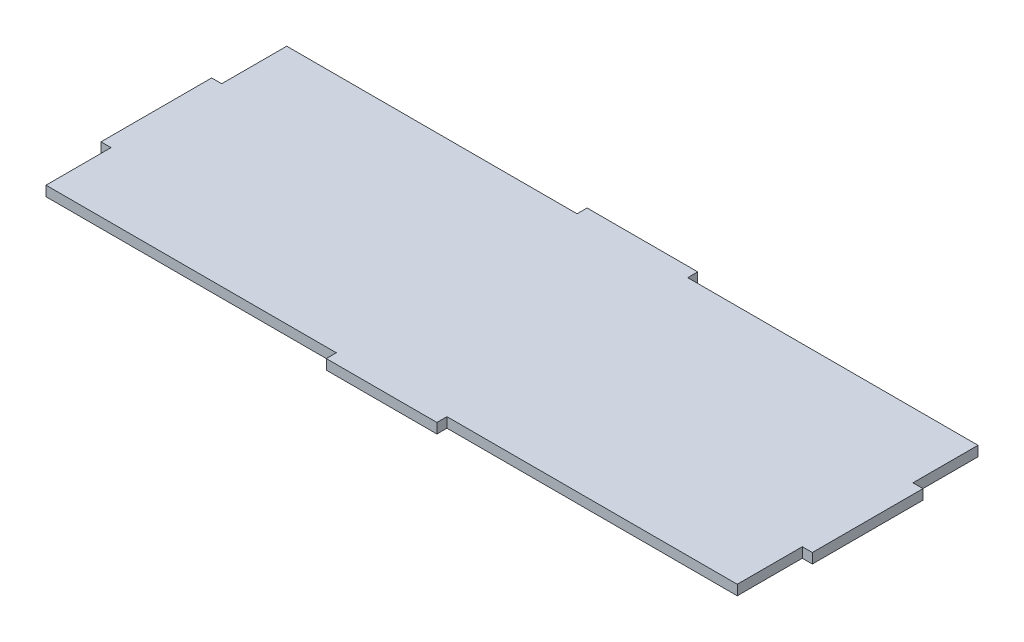
ISO-10303-21;
HEADER;
FILE_DESCRIPTION(('STEP AP214'),'2;1');
FILE_NAME('part.step','',(''),(''),'','','');
FILE_SCHEMA(('AUTOMOTIVE_DESIGN { 1 0 10303 214 1 1 1 1 }'));
ENDSEC;
DATA;
#1=APPLICATION_CONTEXT('core data for automotive mechanical design processes');
#2=APPLICATION_PROTOCOL_DEFINITION('international standard','automotive_design',2000,#1);
#3=PRODUCT_CONTEXT('',#1,'mechanical');
#4=PRODUCT('Part','Part','',(#3));
#5=PRODUCT_RELATED_PRODUCT_CATEGORY('part','',(#4));
#6=PRODUCT_DEFINITION_FORMATION('','',#4);
#7=PRODUCT_DEFINITION_CONTEXT('part definition',#1,'design');
#8=PRODUCT_DEFINITION('design','',#6,#7);
#9=PRODUCT_DEFINITION_SHAPE('','',#8);
#10=(LENGTH_UNIT() NAMED_UNIT(*) SI_UNIT(.MILLI.,.METRE.));
#11=(NAMED_UNIT(*) PLANE_ANGLE_UNIT() SI_UNIT($,.RADIAN.));
#12=(NAMED_UNIT(*) SI_UNIT($,.STERADIAN.) SOLID_ANGLE_UNIT());
#13=UNCERTAINTY_MEASURE_WITH_UNIT(LENGTH_MEASURE(1.E-05),#10,'distance_accuracy_value','');
#14=(GEOMETRIC_REPRESENTATION_CONTEXT(3) GLOBAL_UNCERTAINTY_ASSIGNED_CONTEXT((#13)) GLOBAL_UNIT_ASSIGNED_CONTEXT((#10,
#11,#12)) REPRESENTATION_CONTEXT('',''));
#15=CARTESIAN_POINT('',(0.,0.,0.));
#16=DIRECTION('',(0.,0.,1.));
#17=DIRECTION('',(1.,0.,0.));
#18=AXIS2_PLACEMENT_3D('',#15,#16,#17);
#19=CARTESIAN_POINT('',(-35.0000000000001,6.35,-82.5));
#20=DIRECTION('',(1.,0.,0.));
#21=DIRECTION('',(0.,0.,-1.));
#22=AXIS2_PLACEMENT_3D('',#19,#20,#21);
#23=PLANE('',#22);
#24=DIRECTION('',(0.,0.,1.));
#25=VECTOR('',#24,1.);
#26=CARTESIAN_POINT('',(-35.0000000000001,0.,-82.5));
#27=LINE('',#26,#25);
#28=CARTESIAN_POINT('',(-35.0000000000001,0.,-82.5));
#29=VERTEX_POINT('',#28);
#30=CARTESIAN_POINT('',(-35.0000000000001,0.,-76.15));
#31=VERTEX_POINT('',#30);
#32=EDGE_CURVE('E205',#29,#31,#27,.T.);
#33=ORIENTED_EDGE('',*,*,#32,.T.);
#34=DIRECTION('',(0.,-1.,0.));
#35=VECTOR('',#34,1.);
#36=CARTESIAN_POINT('',(-35.0000000000001,6.35,-76.15));
#37=LINE('',#36,#35);
#38=CARTESIAN_POINT('',(-35.0000000000001,6.35,-76.15));
#39=VERTEX_POINT('',#38);
#40=EDGE_CURVE('E11',#39,#31,#37,.T.);
#41=ORIENTED_EDGE('',*,*,#40,.F.);
#42=DIRECTION('',(0.,0.,1.));
#43=VECTOR('',#42,1.);
#44=CARTESIAN_POINT('',(-35.0000000000001,6.35,-82.5));
#45=LINE('',#44,#43);
#46=CARTESIAN_POINT('',(-35.0000000000001,6.35,-82.5));
#47=VERTEX_POINT('',#46);
#48=EDGE_CURVE('E243',#47,#39,#45,.T.);
#49=ORIENTED_EDGE('',*,*,#48,.F.);
#50=DIRECTION('',(0.,-1.,0.));
#51=VECTOR('',#50,1.);
#52=CARTESIAN_POINT('',(-35.0000000000001,6.35,-82.5));
#53=LINE('',#52,#51);
#54=EDGE_CURVE('E201',#47,#29,#53,.T.);
#55=ORIENTED_EDGE('',*,*,#54,.T.);
#56=EDGE_LOOP('',(#33,#41,#49,#55));
#57=FACE_BOUND('',#56,.T.);
#58=ADVANCED_FACE('F37',(#57),#23,.F.);
#59=CARTESIAN_POINT('',(-218.65,6.35,-76.1499999999999));
#60=DIRECTION('',(0.,0.,1.));
#61=DIRECTION('',(1.,0.,0.));
#62=AXIS2_PLACEMENT_3D('',#59,#60,#61);
#63=PLANE('',#62);
#64=DIRECTION('',(-1.,0.,0.));
#65=VECTOR('',#64,1.);
#66=CARTESIAN_POINT('',(-218.65,0.,-76.1499999999999));
#67=LINE('',#66,#65);
#68=CARTESIAN_POINT('',(-218.65,0.,-76.1499999999999));
#69=VERTEX_POINT('',#68);
#70=EDGE_CURVE('E208',#31,#69,#67,.T.);
#71=ORIENTED_EDGE('',*,*,#70,.T.);
#72=DIRECTION('',(0.,-1.,0.));
#73=VECTOR('',#72,1.);
#74=CARTESIAN_POINT('',(-218.65,6.35,-76.1499999999999));
#75=LINE('',#74,#73);
#76=CARTESIAN_POINT('',(-218.65,6.35,-76.1499999999999));
#77=VERTEX_POINT('',#76);
#78=EDGE_CURVE('E45',#77,#69,#75,.T.);
#79=ORIENTED_EDGE('',*,*,#78,.F.);
#80=DIRECTION('',(-1.,0.,0.));
#81=VECTOR('',#80,1.);
#82=CARTESIAN_POINT('',(-218.65,6.35,-76.1499999999999));
#83=LINE('',#82,#81);
#84=EDGE_CURVE('E132',#39,#77,#83,.T.);
#85=ORIENTED_EDGE('',*,*,#84,.F.);
#86=ORIENTED_EDGE('',*,*,#40,.T.);
#87=EDGE_LOOP('',(#71,#79,#85,#86));
#88=FACE_BOUND('',#87,.T.);
#89=ADVANCED_FACE('F361',(#88),#63,.F.);
#90=CARTESIAN_POINT('',(-218.65,6.35,-76.1499999999999));
#91=DIRECTION('',(1.,0.,0.));
#92=DIRECTION('',(0.,0.,-1.));
#93=AXIS2_PLACEMENT_3D('',#90,#91,#92);
#94=PLANE('',#93);
#95=DIRECTION('',(0.,0.,1.));
#96=VECTOR('',#95,1.);
#97=CARTESIAN_POINT('',(-218.65,0.,-76.1499999999999));
#98=LINE('',#97,#96);
#99=CARTESIAN_POINT('',(-218.65,0.,-35.));
#100=VERTEX_POINT('',#99);
#101=EDGE_CURVE('E210',#69,#100,#98,.T.);
#102=ORIENTED_EDGE('',*,*,#101,.T.);
#103=DIRECTION('',(0.,-1.,0.));
#104=VECTOR('',#103,1.);
#105=CARTESIAN_POINT('',(-218.65,6.35,-35.));
#106=LINE('',#105,#104);
#107=CARTESIAN_POINT('',(-218.65,6.35,-35.));
#108=VERTEX_POINT('',#107);
#109=EDGE_CURVE('E286',#108,#100,#106,.T.);
#110=ORIENTED_EDGE('',*,*,#109,.F.);
#111=DIRECTION('',(0.,0.,1.));
#112=VECTOR('',#111,1.);
#113=CARTESIAN_POINT('',(-218.65,6.35,-76.1499999999999));
#114=LINE('',#113,#112);
#115=EDGE_CURVE('E294',#77,#108,#114,.T.);
#116=ORIENTED_EDGE('',*,*,#115,.F.);
#117=ORIENTED_EDGE('',*,*,#78,.T.);
#118=EDGE_LOOP('',(#102,#110,#116,#117));
#119=FACE_BOUND('',#118,.T.);
#120=ADVANCED_FACE('F292',(#119),#94,.F.);
#121=CARTESIAN_POINT('',(-225.,6.35,-35.));
#122=DIRECTION('',(0.,0.,1.));
#123=DIRECTION('',(1.,0.,0.));
#124=AXIS2_PLACEMENT_3D('',#121,#122,#123);
#125=PLANE('',#124);
#126=DIRECTION('',(-1.,0.,0.));
#127=VECTOR('',#126,1.);
#128=CARTESIAN_POINT('',(-225.,0.,-35.));
#129=LINE('',#128,#127);
#130=CARTESIAN_POINT('',(-225.,0.,-35.));
#131=VERTEX_POINT('',#130);
#132=EDGE_CURVE('E212',#100,#131,#129,.T.);
#133=ORIENTED_EDGE('',*,*,#132,.T.);
#134=DIRECTION('',(0.,-1.,0.));
#135=VECTOR('',#134,1.);
#136=CARTESIAN_POINT('',(-225.,6.35,-35.));
#137=LINE('',#136,#135);
#138=CARTESIAN_POINT('',(-225.,6.35,-35.));
#139=VERTEX_POINT('',#138);
#140=EDGE_CURVE('E283',#139,#131,#137,.T.);
#141=ORIENTED_EDGE('',*,*,#140,.F.);
#142=DIRECTION('',(-1.,0.,0.));
#143=VECTOR('',#142,1.);
#144=CARTESIAN_POINT('',(-225.,6.35,-35.));
#145=LINE('',#144,#143);
#146=EDGE_CURVE('E312',#108,#139,#145,.T.);
#147=ORIENTED_EDGE('',*,*,#146,.F.);
#148=ORIENTED_EDGE('',*,*,#109,.T.);
#149=EDGE_LOOP('',(#133,#141,#147,#148));
#150=FACE_BOUND('',#149,.T.);
#151=ADVANCED_FACE('F303',(#150),#125,.F.);
#152=CARTESIAN_POINT('',(-225.,6.35,35.));
#153=DIRECTION('',(1.,0.,0.));
#154=DIRECTION('',(0.,0.,-1.));
#155=AXIS2_PLACEMENT_3D('',#152,#153,#154);
#156=PLANE('',#155);
#157=DIRECTION('',(0.,0.,1.));
#158=VECTOR('',#157,1.);
#159=CARTESIAN_POINT('',(-225.,0.,35.));
#160=LINE('',#159,#158);
#161=CARTESIAN_POINT('',(-225.,0.,35.));
#162=VERTEX_POINT('',#161);
#163=EDGE_CURVE('E214',#131,#162,#160,.T.);
#164=ORIENTED_EDGE('',*,*,#163,.T.);
#165=DIRECTION('',(0.,-1.,0.));
#166=VECTOR('',#165,1.);
#167=CARTESIAN_POINT('',(-225.,6.35,35.));
#168=LINE('',#167,#166);
#169=CARTESIAN_POINT('',(-225.,6.35,35.));
#170=VERTEX_POINT('',#169);
#171=EDGE_CURVE('E280',#170,#162,#168,.T.);
#172=ORIENTED_EDGE('',*,*,#171,.F.);
#173=DIRECTION('',(0.,0.,1.));
#174=VECTOR('',#173,1.);
#175=CARTESIAN_POINT('',(-225.,6.35,35.));
#176=LINE('',#175,#174);
#177=EDGE_CURVE('E309',#139,#170,#176,.T.);
#178=ORIENTED_EDGE('',*,*,#177,.F.);
#179=ORIENTED_EDGE('',*,*,#140,.T.);
#180=EDGE_LOOP('',(#164,#172,#178,#179));
#181=FACE_BOUND('',#180,.T.);
#182=ADVANCED_FACE('F307',(#181),#156,.F.);
#183=CARTESIAN_POINT('',(-225.,6.35,35.));
#184=DIRECTION('',(0.,0.,-1.));
#185=DIRECTION('',(-1.,0.,0.));
#186=AXIS2_PLACEMENT_3D('',#183,#184,#185);
#187=PLANE('',#186);
#188=DIRECTION('',(1.,0.,0.));
#189=VECTOR('',#188,1.);
#190=CARTESIAN_POINT('',(-225.,0.,35.));
#191=LINE('',#190,#189);
#192=CARTESIAN_POINT('',(-218.65,0.,35.));
#193=VERTEX_POINT('',#192);
#194=EDGE_CURVE('E216',#162,#193,#191,.T.);
#195=ORIENTED_EDGE('',*,*,#194,.T.);
#196=DIRECTION('',(0.,-1.,0.));
#197=VECTOR('',#196,1.);
#198=CARTESIAN_POINT('',(-218.65,6.35,35.));
#199=LINE('',#198,#197);
#200=CARTESIAN_POINT('',(-218.65,6.35,35.));
#201=VERTEX_POINT('',#200);
#202=EDGE_CURVE('E277',#201,#193,#199,.T.);
#203=ORIENTED_EDGE('',*,*,#202,.F.);
#204=DIRECTION('',(1.,0.,0.));
#205=VECTOR('',#204,1.);
#206=CARTESIAN_POINT('',(-225.,6.35,35.));
#207=LINE('',#206,#205);
#208=EDGE_CURVE('E311',#170,#201,#207,.T.);
#209=ORIENTED_EDGE('',*,*,#208,.F.);
#210=ORIENTED_EDGE('',*,*,#171,.T.);
#211=EDGE_LOOP('',(#195,#203,#209,#210));
#212=FACE_BOUND('',#211,.T.);
#213=ADVANCED_FACE('F374',(#212),#187,.F.);
#214=CARTESIAN_POINT('',(-218.65,6.35,76.15));
#215=DIRECTION('',(1.,0.,0.));
#216=DIRECTION('',(0.,0.,-1.));
#217=AXIS2_PLACEMENT_3D('',#214,#215,#216);
#218=PLANE('',#217);
#219=DIRECTION('',(0.,0.,1.));
#220=VECTOR('',#219,1.);
#221=CARTESIAN_POINT('',(-218.65,0.,76.15));
#222=LINE('',#221,#220);
#223=CARTESIAN_POINT('',(-218.65,0.,76.15));
#224=VERTEX_POINT('',#223);
#225=EDGE_CURVE('E218',#193,#224,#222,.T.);
#226=ORIENTED_EDGE('',*,*,#225,.T.);
#227=DIRECTION('',(0.,-1.,0.));
#228=VECTOR('',#227,1.);
#229=CARTESIAN_POINT('',(-218.65,6.35,76.15));
#230=LINE('',#229,#228);
#231=CARTESIAN_POINT('',(-218.65,6.35,76.15));
#232=VERTEX_POINT('',#231);
#233=EDGE_CURVE('E274',#232,#224,#230,.T.);
#234=ORIENTED_EDGE('',*,*,#233,.F.);
#235=DIRECTION('',(0.,0.,1.));
#236=VECTOR('',#235,1.);
#237=CARTESIAN_POINT('',(-218.65,6.35,76.15));
#238=LINE('',#237,#236);
#239=EDGE_CURVE('E314',#201,#232,#238,.T.);
#240=ORIENTED_EDGE('',*,*,#239,.F.);
#241=ORIENTED_EDGE('',*,*,#202,.T.);
#242=EDGE_LOOP('',(#226,#234,#240,#241));
#243=FACE_BOUND('',#242,.T.);
#244=ADVANCED_FACE('F377',(#243),#218,.F.);
#245=CARTESIAN_POINT('',(-218.65,6.35,76.15));
#246=DIRECTION('',(0.,0.,-1.));
#247=DIRECTION('',(-1.,0.,0.));
#248=AXIS2_PLACEMENT_3D('',#245,#246,#247);
#249=PLANE('',#248);
#250=DIRECTION('',(1.,0.,0.));
#251=VECTOR('',#250,1.);
#252=CARTESIAN_POINT('',(-218.65,0.,76.15));
#253=LINE('',#252,#251);
#254=CARTESIAN_POINT('',(-35.0000000000001,0.,76.15));
#255=VERTEX_POINT('',#254);
#256=EDGE_CURVE('E220',#224,#255,#253,.T.);
#257=ORIENTED_EDGE('',*,*,#256,.T.);
#258=DIRECTION('',(0.,-1.,0.));
#259=VECTOR('',#258,1.);
#260=CARTESIAN_POINT('',(-35.0000000000001,6.35,76.15));
#261=LINE('',#260,#259);
#262=CARTESIAN_POINT('',(-35.0000000000001,6.35,76.15));
#263=VERTEX_POINT('',#262);
#264=EDGE_CURVE('E271',#263,#255,#261,.T.);
#265=ORIENTED_EDGE('',*,*,#264,.F.);
#266=DIRECTION('',(1.,0.,0.));
#267=VECTOR('',#266,1.);
#268=CARTESIAN_POINT('',(-218.65,6.35,76.15));
#269=LINE('',#268,#267);
#270=EDGE_CURVE('E320',#232,#263,#269,.T.);
#271=ORIENTED_EDGE('',*,*,#270,.F.);
#272=ORIENTED_EDGE('',*,*,#233,.T.);
#273=EDGE_LOOP('',(#257,#265,#271,#272));
#274=FACE_BOUND('',#273,.T.);
#275=ADVANCED_FACE('F381',(#274),#249,.F.);
#276=CARTESIAN_POINT('',(-35.0000000000001,6.35,82.5));
#277=DIRECTION('',(1.,0.,0.));
#278=DIRECTION('',(0.,0.,-1.));
#279=AXIS2_PLACEMENT_3D('',#276,#277,#278);
#280=PLANE('',#279);
#281=DIRECTION('',(0.,0.,1.));
#282=VECTOR('',#281,1.);
#283=CARTESIAN_POINT('',(-35.0000000000001,0.,82.5));
#284=LINE('',#283,#282);
#285=CARTESIAN_POINT('',(-35.0000000000001,0.,82.5));
#286=VERTEX_POINT('',#285);
#287=EDGE_CURVE('E222',#255,#286,#284,.T.);
#288=ORIENTED_EDGE('',*,*,#287,.T.);
#289=DIRECTION('',(0.,-1.,0.));
#290=VECTOR('',#289,1.);
#291=CARTESIAN_POINT('',(-35.0000000000001,6.35,82.5));
#292=LINE('',#291,#290);
#293=CARTESIAN_POINT('',(-35.0000000000001,6.35,82.5));
#294=VERTEX_POINT('',#293);
#295=EDGE_CURVE('E268',#294,#286,#292,.T.);
#296=ORIENTED_EDGE('',*,*,#295,.F.);
#297=DIRECTION('',(0.,0.,1.));
#298=VECTOR('',#297,1.);
#299=CARTESIAN_POINT('',(-35.0000000000001,6.35,82.5));
#300=LINE('',#299,#298);
#301=EDGE_CURVE('E322',#263,#294,#300,.T.);
#302=ORIENTED_EDGE('',*,*,#301,.F.);
#303=ORIENTED_EDGE('',*,*,#264,.T.);
#304=EDGE_LOOP('',(#288,#296,#302,#303));
#305=FACE_BOUND('',#304,.T.);
#306=ADVANCED_FACE('F385',(#305),#280,.F.);
#307=CARTESIAN_POINT('',(34.9999999999999,6.35,82.5000000000001));
#308=DIRECTION('',(0.,0.,-1.));
#309=DIRECTION('',(-1.,0.,0.));
#310=AXIS2_PLACEMENT_3D('',#307,#308,#309);
#311=PLANE('',#310);
#312=DIRECTION('',(1.,0.,0.));
#313=VECTOR('',#312,1.);
#314=CARTESIAN_POINT('',(34.9999999999999,0.,82.5000000000001));
#315=LINE('',#314,#313);
#316=CARTESIAN_POINT('',(34.9999999999999,0.,82.5000000000001));
#317=VERTEX_POINT('',#316);
#318=EDGE_CURVE('E224',#286,#317,#315,.T.);
#319=ORIENTED_EDGE('',*,*,#318,.T.);
#320=DIRECTION('',(0.,-1.,0.));
#321=VECTOR('',#320,1.);
#322=CARTESIAN_POINT('',(34.9999999999999,6.35,82.5000000000001));
#323=LINE('',#322,#321);
#324=CARTESIAN_POINT('',(34.9999999999999,6.35,82.5000000000001));
#325=VERTEX_POINT('',#324);
#326=EDGE_CURVE('E265',#325,#317,#323,.T.);
#327=ORIENTED_EDGE('',*,*,#326,.F.);
#328=DIRECTION('',(1.,0.,0.));
#329=VECTOR('',#328,1.);
#330=CARTESIAN_POINT('',(34.9999999999999,6.35,82.5000000000001));
#331=LINE('',#330,#329);
#332=EDGE_CURVE('E324',#294,#325,#331,.T.);
#333=ORIENTED_EDGE('',*,*,#332,.F.);
#334=ORIENTED_EDGE('',*,*,#295,.T.);
#335=EDGE_LOOP('',(#319,#327,#333,#334));
#336=FACE_BOUND('',#335,.T.);
#337=ADVANCED_FACE('F389',(#336),#311,.F.);
#338=CARTESIAN_POINT('',(34.9999999999999,6.35,82.5000000000001));
#339=DIRECTION('',(-1.,0.,0.));
#340=DIRECTION('',(0.,0.,1.));
#341=AXIS2_PLACEMENT_3D('',#338,#339,#340);
#342=PLANE('',#341);
#343=DIRECTION('',(0.,0.,-1.));
#344=VECTOR('',#343,1.);
#345=CARTESIAN_POINT('',(34.9999999999999,0.,82.5000000000001));
#346=LINE('',#345,#344);
#347=CARTESIAN_POINT('',(34.9999999999999,0.,76.1500000000001));
#348=VERTEX_POINT('',#347);
#349=EDGE_CURVE('E226',#317,#348,#346,.T.);
#350=ORIENTED_EDGE('',*,*,#349,.T.);
#351=DIRECTION('',(0.,-1.,0.));
#352=VECTOR('',#351,1.);
#353=CARTESIAN_POINT('',(34.9999999999999,6.35,76.1500000000001));
#354=LINE('',#353,#352);
#355=CARTESIAN_POINT('',(34.9999999999999,6.35,76.1500000000001));
#356=VERTEX_POINT('',#355);
#357=EDGE_CURVE('E262',#356,#348,#354,.T.);
#358=ORIENTED_EDGE('',*,*,#357,.F.);
#359=DIRECTION('',(0.,0.,-1.));
#360=VECTOR('',#359,1.);
#361=CARTESIAN_POINT('',(34.9999999999999,6.35,82.5000000000001));
#362=LINE('',#361,#360);
#363=EDGE_CURVE('E326',#325,#356,#362,.T.);
#364=ORIENTED_EDGE('',*,*,#363,.F.);
#365=ORIENTED_EDGE('',*,*,#326,.T.);
#366=EDGE_LOOP('',(#350,#358,#364,#365));
#367=FACE_BOUND('',#366,.T.);
#368=ADVANCED_FACE('F393',(#367),#342,.F.);
#369=CARTESIAN_POINT('',(218.65,6.35,76.15));
#370=DIRECTION('',(0.,0.,-1.));
#371=DIRECTION('',(-1.,0.,0.));
#372=AXIS2_PLACEMENT_3D('',#369,#370,#371);
#373=PLANE('',#372);
#374=DIRECTION('',(1.,0.,0.));
#375=VECTOR('',#374,1.);
#376=CARTESIAN_POINT('',(218.65,0.,76.15));
#377=LINE('',#376,#375);
#378=CARTESIAN_POINT('',(218.65,0.,76.15));
#379=VERTEX_POINT('',#378);
#380=EDGE_CURVE('E228',#348,#379,#377,.T.);
#381=ORIENTED_EDGE('',*,*,#380,.T.);
#382=DIRECTION('',(0.,-1.,0.));
#383=VECTOR('',#382,1.);
#384=CARTESIAN_POINT('',(218.65,6.35,76.15));
#385=LINE('',#384,#383);
#386=CARTESIAN_POINT('',(218.65,6.35,76.15));
#387=VERTEX_POINT('',#386);
#388=EDGE_CURVE('E259',#387,#379,#385,.T.);
#389=ORIENTED_EDGE('',*,*,#388,.F.);
#390=DIRECTION('',(1.,0.,0.));
#391=VECTOR('',#390,1.);
#392=CARTESIAN_POINT('',(218.65,6.35,76.15));
#393=LINE('',#392,#391);
#394=EDGE_CURVE('E328',#356,#387,#393,.T.);
#395=ORIENTED_EDGE('',*,*,#394,.F.);
#396=ORIENTED_EDGE('',*,*,#357,.T.);
#397=EDGE_LOOP('',(#381,#389,#395,#396));
#398=FACE_BOUND('',#397,.T.);
#399=ADVANCED_FACE('F397',(#398),#373,.F.);
#400=CARTESIAN_POINT('',(218.65,6.35,76.15));
#401=DIRECTION('',(-1.,0.,0.));
#402=DIRECTION('',(0.,0.,1.));
#403=AXIS2_PLACEMENT_3D('',#400,#401,#402);
#404=PLANE('',#403);
#405=DIRECTION('',(0.,0.,-1.));
#406=VECTOR('',#405,1.);
#407=CARTESIAN_POINT('',(218.65,0.,76.15));
#408=LINE('',#407,#406);
#409=CARTESIAN_POINT('',(218.65,0.,35.));
#410=VERTEX_POINT('',#409);
#411=EDGE_CURVE('E230',#379,#410,#408,.T.);
#412=ORIENTED_EDGE('',*,*,#411,.T.);
#413=DIRECTION('',(0.,-1.,0.));
#414=VECTOR('',#413,1.);
#415=CARTESIAN_POINT('',(218.65,6.35,35.));
#416=LINE('',#415,#414);
#417=CARTESIAN_POINT('',(218.65,6.35,35.));
#418=VERTEX_POINT('',#417);
#419=EDGE_CURVE('E256',#418,#410,#416,.T.);
#420=ORIENTED_EDGE('',*,*,#419,.F.);
#421=DIRECTION('',(0.,0.,-1.));
#422=VECTOR('',#421,1.);
#423=CARTESIAN_POINT('',(218.65,6.35,76.15));
#424=LINE('',#423,#422);
#425=EDGE_CURVE('E330',#387,#418,#424,.T.);
#426=ORIENTED_EDGE('',*,*,#425,.F.);
#427=ORIENTED_EDGE('',*,*,#388,.T.);
#428=EDGE_LOOP('',(#412,#420,#426,#427));
#429=FACE_BOUND('',#428,.T.);
#430=ADVANCED_FACE('F401',(#429),#404,.F.);
#431=CARTESIAN_POINT('',(225.,6.35,35.));
#432=DIRECTION('',(0.,0.,-1.));
#433=DIRECTION('',(-1.,0.,0.));
#434=AXIS2_PLACEMENT_3D('',#431,#432,#433);
#435=PLANE('',#434);
#436=DIRECTION('',(1.,0.,0.));
#437=VECTOR('',#436,1.);
#438=CARTESIAN_POINT('',(225.,0.,35.));
#439=LINE('',#438,#437);
#440=CARTESIAN_POINT('',(225.,0.,35.));
#441=VERTEX_POINT('',#440);
#442=EDGE_CURVE('E232',#410,#441,#439,.T.);
#443=ORIENTED_EDGE('',*,*,#442,.T.);
#444=DIRECTION('',(0.,-1.,0.));
#445=VECTOR('',#444,1.);
#446=CARTESIAN_POINT('',(225.,6.35,35.));
#447=LINE('',#446,#445);
#448=CARTESIAN_POINT('',(225.,6.35,35.));
#449=VERTEX_POINT('',#448);
#450=EDGE_CURVE('E253',#449,#441,#447,.T.);
#451=ORIENTED_EDGE('',*,*,#450,.F.);
#452=DIRECTION('',(1.,0.,0.));
#453=VECTOR('',#452,1.);
#454=CARTESIAN_POINT('',(225.,6.35,35.));
#455=LINE('',#454,#453);
#456=EDGE_CURVE('E332',#418,#449,#455,.T.);
#457=ORIENTED_EDGE('',*,*,#456,.F.);
#458=ORIENTED_EDGE('',*,*,#419,.T.);
#459=EDGE_LOOP('',(#443,#451,#457,#458));
#460=FACE_BOUND('',#459,.T.);
#461=ADVANCED_FACE('F405',(#460),#435,.F.);
#462=CARTESIAN_POINT('',(225.,6.35,35.));
#463=DIRECTION('',(-1.,0.,0.));
#464=DIRECTION('',(0.,0.,1.));
#465=AXIS2_PLACEMENT_3D('',#462,#463,#464);
#466=PLANE('',#465);
#467=DIRECTION('',(0.,0.,-1.));
#468=VECTOR('',#467,1.);
#469=CARTESIAN_POINT('',(225.,0.,35.));
#470=LINE('',#469,#468);
#471=CARTESIAN_POINT('',(225.,0.,-35.));
#472=VERTEX_POINT('',#471);
#473=EDGE_CURVE('E234',#441,#472,#470,.T.);
#474=ORIENTED_EDGE('',*,*,#473,.T.);
#475=DIRECTION('',(0.,-1.,0.));
#476=VECTOR('',#475,1.);
#477=CARTESIAN_POINT('',(225.,6.35,-35.));
#478=LINE('',#477,#476);
#479=CARTESIAN_POINT('',(225.,6.35,-35.));
#480=VERTEX_POINT('',#479);
#481=EDGE_CURVE('E250',#480,#472,#478,.T.);
#482=ORIENTED_EDGE('',*,*,#481,.F.);
#483=DIRECTION('',(0.,0.,-1.));
#484=VECTOR('',#483,1.);
#485=CARTESIAN_POINT('',(225.,6.35,35.));
#486=LINE('',#485,#484);
#487=EDGE_CURVE('E334',#449,#480,#486,.T.);
#488=ORIENTED_EDGE('',*,*,#487,.F.);
#489=ORIENTED_EDGE('',*,*,#450,.T.);
#490=EDGE_LOOP('',(#474,#482,#488,#489));
#491=FACE_BOUND('',#490,.T.);
#492=ADVANCED_FACE('F409',(#491),#466,.F.);
#493=CARTESIAN_POINT('',(225.,6.35,-35.));
#494=DIRECTION('',(0.,0.,1.));
#495=DIRECTION('',(1.,0.,0.));
#496=AXIS2_PLACEMENT_3D('',#493,#494,#495);
#497=PLANE('',#496);
#498=DIRECTION('',(-1.,0.,0.));
#499=VECTOR('',#498,1.);
#500=CARTESIAN_POINT('',(225.,0.,-35.));
#501=LINE('',#500,#499);
#502=CARTESIAN_POINT('',(218.65,0.,-35.));
#503=VERTEX_POINT('',#502);
#504=EDGE_CURVE('E236',#472,#503,#501,.T.);
#505=ORIENTED_EDGE('',*,*,#504,.T.);
#506=DIRECTION('',(0.,-1.,0.));
#507=VECTOR('',#506,1.);
#508=CARTESIAN_POINT('',(218.65,6.35,-35.));
#509=LINE('',#508,#507);
#510=CARTESIAN_POINT('',(218.65,6.35,-35.));
#511=VERTEX_POINT('',#510);
#512=EDGE_CURVE('E247',#511,#503,#509,.T.);
#513=ORIENTED_EDGE('',*,*,#512,.F.);
#514=DIRECTION('',(-1.,0.,0.));
#515=VECTOR('',#514,1.);
#516=CARTESIAN_POINT('',(225.,6.35,-35.));
#517=LINE('',#516,#515);
#518=EDGE_CURVE('E336',#480,#511,#517,.T.);
#519=ORIENTED_EDGE('',*,*,#518,.F.);
#520=ORIENTED_EDGE('',*,*,#481,.T.);
#521=EDGE_LOOP('',(#505,#513,#519,#520));
#522=FACE_BOUND('',#521,.T.);
#523=ADVANCED_FACE('F342',(#522),#497,.F.);
#524=CARTESIAN_POINT('',(218.65,6.35,-76.1499999999999));
#525=DIRECTION('',(-1.,0.,0.));
#526=DIRECTION('',(0.,0.,1.));
#527=AXIS2_PLACEMENT_3D('',#524,#525,#526);
#528=PLANE('',#527);
#529=DIRECTION('',(0.,0.,-1.));
#530=VECTOR('',#529,1.);
#531=CARTESIAN_POINT('',(218.65,0.,-76.1499999999999));
#532=LINE('',#531,#530);
#533=CARTESIAN_POINT('',(218.65,0.,-76.1499999999999));
#534=VERTEX_POINT('',#533);
#535=EDGE_CURVE('E238',#503,#534,#532,.T.);
#536=ORIENTED_EDGE('',*,*,#535,.T.);
#537=DIRECTION('',(0.,-1.,0.));
#538=VECTOR('',#537,1.);
#539=CARTESIAN_POINT('',(218.65,6.35,-76.1499999999999));
#540=LINE('',#539,#538);
#541=CARTESIAN_POINT('',(218.65,6.35,-76.1499999999999));
#542=VERTEX_POINT('',#541);
#543=EDGE_CURVE('E196',#542,#534,#540,.T.);
#544=ORIENTED_EDGE('',*,*,#543,.F.);
#545=DIRECTION('',(0.,0.,-1.));
#546=VECTOR('',#545,1.);
#547=CARTESIAN_POINT('',(218.65,6.35,-76.1499999999999));
#548=LINE('',#547,#546);
#549=EDGE_CURVE('E187',#511,#542,#548,.T.);
#550=ORIENTED_EDGE('',*,*,#549,.F.);
#551=ORIENTED_EDGE('',*,*,#512,.T.);
#552=EDGE_LOOP('',(#536,#544,#550,#551));
#553=FACE_BOUND('',#552,.T.);
#554=ADVANCED_FACE('F346',(#553),#528,.F.);
#555=CARTESIAN_POINT('',(218.65,6.35,-76.1499999999999));
#556=DIRECTION('',(0.,0.,1.));
#557=DIRECTION('',(1.,0.,0.));
#558=AXIS2_PLACEMENT_3D('',#555,#556,#557);
#559=PLANE('',#558);
#560=DIRECTION('',(-1.,0.,0.));
#561=VECTOR('',#560,1.);
#562=CARTESIAN_POINT('',(218.65,0.,-76.1499999999999));
#563=LINE('',#562,#561);
#564=CARTESIAN_POINT('',(34.9999999999999,0.,-76.15));
#565=VERTEX_POINT('',#564);
#566=EDGE_CURVE('E195',#534,#565,#563,.T.);
#567=ORIENTED_EDGE('',*,*,#566,.T.);
#568=DIRECTION('',(0.,-1.,0.));
#569=VECTOR('',#568,1.);
#570=CARTESIAN_POINT('',(34.9999999999999,6.35,-76.15));
#571=LINE('',#570,#569);
#572=CARTESIAN_POINT('',(34.9999999999999,6.35,-76.15));
#573=VERTEX_POINT('',#572);
#574=EDGE_CURVE('E192',#573,#565,#571,.T.);
#575=ORIENTED_EDGE('',*,*,#574,.F.);
#576=DIRECTION('',(-1.,0.,0.));
#577=VECTOR('',#576,1.);
#578=CARTESIAN_POINT('',(218.65,6.35,-76.1499999999999));
#579=LINE('',#578,#577);
#580=EDGE_CURVE('E181',#542,#573,#579,.T.);
#581=ORIENTED_EDGE('',*,*,#580,.F.);
#582=ORIENTED_EDGE('',*,*,#543,.T.);
#583=EDGE_LOOP('',(#567,#575,#581,#582));
#584=FACE_BOUND('',#583,.T.);
#585=ADVANCED_FACE('F193',(#584),#559,.F.);
#586=CARTESIAN_POINT('',(35.,6.35,-82.5));
#587=DIRECTION('',(-1.,0.,0.));
#588=DIRECTION('',(0.,0.,1.));
#589=AXIS2_PLACEMENT_3D('',#586,#587,#588);
#590=PLANE('',#589);
#591=DIRECTION('',(0.,0.,-1.));
#592=VECTOR('',#591,1.);
#593=CARTESIAN_POINT('',(35.,0.,-82.5));
#594=LINE('',#593,#592);
#595=CARTESIAN_POINT('',(35.,0.,-82.5));
#596=VERTEX_POINT('',#595);
#597=EDGE_CURVE('E118',#565,#596,#594,.T.);
#598=ORIENTED_EDGE('',*,*,#597,.T.);
#599=DIRECTION('',(0.,-1.,0.));
#600=VECTOR('',#599,1.);
#601=CARTESIAN_POINT('',(35.,6.35,-82.5));
#602=LINE('',#601,#600);
#603=CARTESIAN_POINT('',(35.,6.35,-82.5));
#604=VERTEX_POINT('',#603);
#605=EDGE_CURVE('E197',#604,#596,#602,.T.);
#606=ORIENTED_EDGE('',*,*,#605,.F.);
#607=DIRECTION('',(0.,0.,-1.));
#608=VECTOR('',#607,1.);
#609=CARTESIAN_POINT('',(35.,6.35,-82.5));
#610=LINE('',#609,#608);
#611=EDGE_CURVE('E185',#573,#604,#610,.T.);
#612=ORIENTED_EDGE('',*,*,#611,.F.);
#613=ORIENTED_EDGE('',*,*,#574,.T.);
#614=EDGE_LOOP('',(#598,#606,#612,#613));
#615=FACE_BOUND('',#614,.T.);
#616=ADVANCED_FACE('F199',(#615),#590,.F.);
#617=CARTESIAN_POINT('',(35.,6.35,-82.5));
#618=DIRECTION('',(0.,0.,1.));
#619=DIRECTION('',(1.,0.,0.));
#620=AXIS2_PLACEMENT_3D('',#617,#618,#619);
#621=PLANE('',#620);
#622=DIRECTION('',(-1.,0.,0.));
#623=VECTOR('',#622,1.);
#624=CARTESIAN_POINT('',(35.,0.,-82.5));
#625=LINE('',#624,#623);
#626=EDGE_CURVE('E124',#596,#29,#625,.T.);
#627=ORIENTED_EDGE('',*,*,#626,.T.);
#628=ORIENTED_EDGE('',*,*,#54,.F.);
#629=DIRECTION('',(-1.,0.,0.));
#630=VECTOR('',#629,1.);
#631=CARTESIAN_POINT('',(35.,6.35,-82.5));
#632=LINE('',#631,#630);
#633=EDGE_CURVE('E53',#604,#47,#632,.T.);
#634=ORIENTED_EDGE('',*,*,#633,.F.);
#635=ORIENTED_EDGE('',*,*,#605,.T.);
#636=EDGE_LOOP('',(#627,#628,#634,#635));
#637=FACE_BOUND('',#636,.T.);
#638=ADVANCED_FACE('F350',(#637),#621,.F.);
#639=CARTESIAN_POINT('',(0.,6.35,0.));
#640=DIRECTION('',(0.,1.,0.));
#641=DIRECTION('',(0.,0.,1.));
#642=AXIS2_PLACEMENT_3D('',#639,#640,#641);
#643=PLANE('',#642);
#644=ORIENTED_EDGE('',*,*,#48,.T.);
#645=ORIENTED_EDGE('',*,*,#84,.T.);
#646=ORIENTED_EDGE('',*,*,#115,.T.);
#647=ORIENTED_EDGE('',*,*,#146,.T.);
#648=ORIENTED_EDGE('',*,*,#177,.T.);
#649=ORIENTED_EDGE('',*,*,#208,.T.);
#650=ORIENTED_EDGE('',*,*,#239,.T.);
#651=ORIENTED_EDGE('',*,*,#270,.T.);
#652=ORIENTED_EDGE('',*,*,#301,.T.);
#653=ORIENTED_EDGE('',*,*,#332,.T.);
#654=ORIENTED_EDGE('',*,*,#363,.T.);
#655=ORIENTED_EDGE('',*,*,#394,.T.);
#656=ORIENTED_EDGE('',*,*,#425,.T.);
#657=ORIENTED_EDGE('',*,*,#456,.T.);
#658=ORIENTED_EDGE('',*,*,#487,.T.);
#659=ORIENTED_EDGE('',*,*,#518,.T.);
#660=ORIENTED_EDGE('',*,*,#549,.T.);
#661=ORIENTED_EDGE('',*,*,#580,.T.);
#662=ORIENTED_EDGE('',*,*,#611,.T.);
#663=ORIENTED_EDGE('',*,*,#633,.T.);
#664=EDGE_LOOP('',(#644,#645,#646,#647,#648,#649,#650,#651,#652,#653,#654,#655,#656,#657,#658,
#659,#660,#661,#662,#663));
#665=FACE_BOUND('',#664,.T.);
#666=ADVANCED_FACE('F183',(#665),#643,.T.);
#667=CARTESIAN_POINT('',(0.,0.,0.));
#668=DIRECTION('',(0.,1.,0.));
#669=DIRECTION('',(0.,0.,1.));
#670=AXIS2_PLACEMENT_3D('',#667,#668,#669);
#671=PLANE('',#670);
#672=ORIENTED_EDGE('',*,*,#32,.F.);
#673=ORIENTED_EDGE('',*,*,#626,.F.);
#674=ORIENTED_EDGE('',*,*,#597,.F.);
#675=ORIENTED_EDGE('',*,*,#566,.F.);
#676=ORIENTED_EDGE('',*,*,#535,.F.);
#677=ORIENTED_EDGE('',*,*,#504,.F.);
#678=ORIENTED_EDGE('',*,*,#473,.F.);
#679=ORIENTED_EDGE('',*,*,#442,.F.);
#680=ORIENTED_EDGE('',*,*,#411,.F.);
#681=ORIENTED_EDGE('',*,*,#380,.F.);
#682=ORIENTED_EDGE('',*,*,#349,.F.);
#683=ORIENTED_EDGE('',*,*,#318,.F.);
#684=ORIENTED_EDGE('',*,*,#287,.F.);
#685=ORIENTED_EDGE('',*,*,#256,.F.);
#686=ORIENTED_EDGE('',*,*,#225,.F.);
#687=ORIENTED_EDGE('',*,*,#194,.F.);
#688=ORIENTED_EDGE('',*,*,#163,.F.);
#689=ORIENTED_EDGE('',*,*,#132,.F.);
#690=ORIENTED_EDGE('',*,*,#101,.F.);
#691=ORIENTED_EDGE('',*,*,#70,.F.);
#692=EDGE_LOOP('',(#672,#673,#674,#675,#676,#677,#678,#679,#680,#681,#682,#683,#684,#685,#686,
#687,#688,#689,#690,#691));
#693=FACE_BOUND('',#692,.T.);
#694=ADVANCED_FACE('F298',(#693),#671,.F.);
#695=CLOSED_SHELL('',(#58,#89,#120,#151,#182,#213,#244,#275,#306,#337,#368,#399,#430,#461,#492,
#523,#554,#585,#616,#638,#666,#694));
#696=MANIFOLD_SOLID_BREP('B2',#695);
#697=ADVANCED_BREP_SHAPE_REPRESENTATION('',(#18,#696),#14);
#698=SHAPE_DEFINITION_REPRESENTATION(#9,#697);
ENDSEC;
END-ISO-10303-21;
